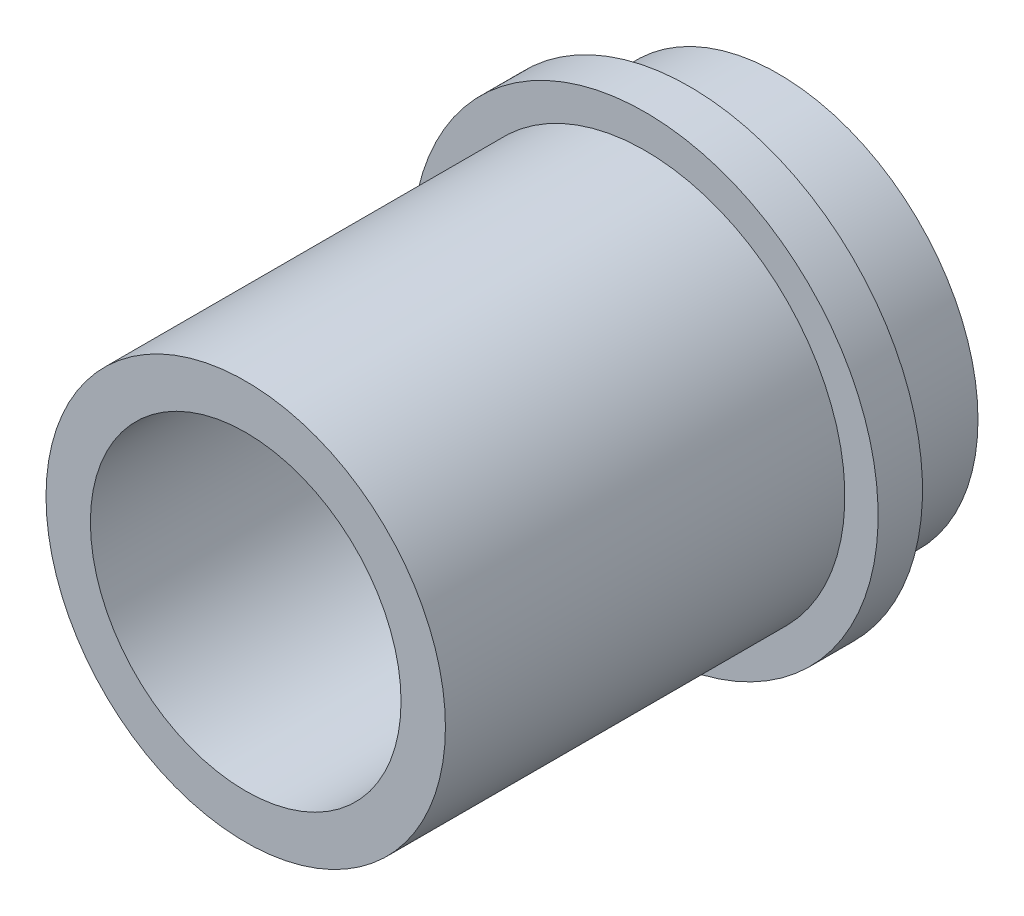
ISO-10303-21;
HEADER;
FILE_DESCRIPTION(('STEP AP214'),'2;1');
FILE_NAME('part.step','',(''),(''),'','','');
FILE_SCHEMA(('AUTOMOTIVE_DESIGN { 1 0 10303 214 1 1 1 1 }'));
ENDSEC;
DATA;
#1=APPLICATION_CONTEXT('core data for automotive mechanical design processes');
#2=APPLICATION_PROTOCOL_DEFINITION('international standard','automotive_design',2000,#1);
#3=PRODUCT_CONTEXT('',#1,'mechanical');
#4=PRODUCT('Part','Part','',(#3));
#5=PRODUCT_RELATED_PRODUCT_CATEGORY('part','',(#4));
#6=PRODUCT_DEFINITION_FORMATION('','',#4);
#7=PRODUCT_DEFINITION_CONTEXT('part definition',#1,'design');
#8=PRODUCT_DEFINITION('design','',#6,#7);
#9=PRODUCT_DEFINITION_SHAPE('','',#8);
#10=(LENGTH_UNIT() NAMED_UNIT(*) SI_UNIT(.MILLI.,.METRE.));
#11=(NAMED_UNIT(*) PLANE_ANGLE_UNIT() SI_UNIT($,.RADIAN.));
#12=(NAMED_UNIT(*) SI_UNIT($,.STERADIAN.) SOLID_ANGLE_UNIT());
#13=UNCERTAINTY_MEASURE_WITH_UNIT(LENGTH_MEASURE(1.E-05),#10,'distance_accuracy_value','');
#14=(GEOMETRIC_REPRESENTATION_CONTEXT(3) GLOBAL_UNCERTAINTY_ASSIGNED_CONTEXT((#13)) GLOBAL_UNIT_ASSIGNED_CONTEXT((#10,
#11,#12)) REPRESENTATION_CONTEXT('',''));
#15=CARTESIAN_POINT('',(0.,0.,0.));
#16=DIRECTION('',(0.,0.,1.));
#17=DIRECTION('',(1.,0.,0.));
#18=AXIS2_PLACEMENT_3D('',#15,#16,#17);
#19=CARTESIAN_POINT('',(0.,0.,20.));
#20=DIRECTION('',(0.,0.,-1.));
#21=DIRECTION('',(-1.,0.,0.));
#22=AXIS2_PLACEMENT_3D('',#19,#20,#21);
#23=CYLINDRICAL_SURFACE('',#22,4.5);
#24=CARTESIAN_POINT('',(0.,0.,20.));
#25=DIRECTION('',(0.,0.,1.));
#26=DIRECTION('',(1.,0.,0.));
#27=AXIS2_PLACEMENT_3D('',#24,#25,#26);
#28=CIRCLE('',#27,4.5);
#29=CARTESIAN_POINT('',(4.5,0.,20.));
#30=VERTEX_POINT('',#29);
#31=EDGE_CURVE('E40',#30,#30,#28,.T.);
#32=ORIENTED_EDGE('',*,*,#31,.F.);
#33=EDGE_LOOP('',(#32));
#34=FACE_BOUND('',#33,.T.);
#35=CARTESIAN_POINT('',(0.,0.,11.));
#36=DIRECTION('',(0.,0.,-1.));
#37=DIRECTION('',(-1.,0.,0.));
#38=AXIS2_PLACEMENT_3D('',#35,#36,#37);
#39=CIRCLE('',#38,4.5);
#40=CARTESIAN_POINT('',(-4.5,0.,11.));
#41=VERTEX_POINT('',#40);
#42=EDGE_CURVE('E10',#41,#41,#39,.T.);
#43=ORIENTED_EDGE('',*,*,#42,.F.);
#44=EDGE_LOOP('',(#43));
#45=FACE_BOUND('',#44,.T.);
#46=ADVANCED_FACE('F32',(#34,#45),#23,.T.);
#47=CARTESIAN_POINT('',(0.,0.,20.));
#48=DIRECTION('',(0.,0.,1.));
#49=DIRECTION('',(1.,0.,0.));
#50=AXIS2_PLACEMENT_3D('',#47,#48,#49);
#51=PLANE('',#50);
#52=ORIENTED_EDGE('',*,*,#31,.T.);
#53=EDGE_LOOP('',(#52));
#54=FACE_BOUND('',#53,.T.);
#55=CARTESIAN_POINT('',(0.,0.,20.));
#56=DIRECTION('',(0.,0.,1.));
#57=DIRECTION('',(1.,0.,0.));
#58=AXIS2_PLACEMENT_3D('',#55,#56,#57);
#59=CIRCLE('',#58,3.5);
#60=CARTESIAN_POINT('',(3.5,0.,20.));
#61=VERTEX_POINT('',#60);
#62=EDGE_CURVE('E49',#61,#61,#59,.T.);
#63=ORIENTED_EDGE('',*,*,#62,.F.);
#64=EDGE_LOOP('',(#63));
#65=FACE_BOUND('',#64,.T.);
#66=ADVANCED_FACE('F81',(#54,#65),#51,.T.);
#67=CARTESIAN_POINT('',(0.,0.,8.));
#68=DIRECTION('',(0.,0.,1.));
#69=DIRECTION('',(1.,0.,0.));
#70=AXIS2_PLACEMENT_3D('',#67,#68,#69);
#71=PLANE('',#70);
#72=CARTESIAN_POINT('',(0.,0.,8.));
#73=DIRECTION('',(0.,0.,1.));
#74=DIRECTION('',(1.,0.,0.));
#75=AXIS2_PLACEMENT_3D('',#72,#73,#74);
#76=CIRCLE('',#75,4.5);
#77=CARTESIAN_POINT('',(4.5,0.,8.));
#78=VERTEX_POINT('',#77);
#79=EDGE_CURVE('E36',#78,#78,#76,.T.);
#80=ORIENTED_EDGE('',*,*,#79,.F.);
#81=EDGE_LOOP('',(#80));
#82=FACE_BOUND('',#81,.T.);
#83=CARTESIAN_POINT('',(0.,0.,8.));
#84=DIRECTION('',(0.,0.,1.));
#85=DIRECTION('',(1.,0.,0.));
#86=AXIS2_PLACEMENT_3D('',#83,#84,#85);
#87=CIRCLE('',#86,3.5);
#88=CARTESIAN_POINT('',(3.5,0.,8.));
#89=VERTEX_POINT('',#88);
#90=EDGE_CURVE('E52',#89,#89,#87,.T.);
#91=ORIENTED_EDGE('',*,*,#90,.T.);
#92=EDGE_LOOP('',(#91));
#93=FACE_BOUND('',#92,.T.);
#94=ADVANCED_FACE('F86',(#82,#93),#71,.F.);
#95=CARTESIAN_POINT('',(0.,0.,10.));
#96=DIRECTION('',(0.,0.,-1.));
#97=DIRECTION('',(-1.,0.,0.));
#98=AXIS2_PLACEMENT_3D('',#95,#96,#97);
#99=CIRCLE('',#98,4.5);
#100=CARTESIAN_POINT('',(-4.5,0.,10.));
#101=VERTEX_POINT('',#100);
#102=EDGE_CURVE('E47',#101,#101,#99,.T.);
#103=ORIENTED_EDGE('',*,*,#102,.T.);
#104=EDGE_LOOP('',(#103));
#105=FACE_BOUND('',#104,.T.);
#106=ORIENTED_EDGE('',*,*,#79,.T.);
#107=EDGE_LOOP('',(#106));
#108=FACE_BOUND('',#107,.T.);
#109=ADVANCED_FACE('F34',(#105,#108),#23,.T.);
#110=CARTESIAN_POINT('',(0.,0.,20.));
#111=DIRECTION('',(0.,0.,-1.));
#112=DIRECTION('',(-1.,0.,0.));
#113=AXIS2_PLACEMENT_3D('',#110,#111,#112);
#114=CYLINDRICAL_SURFACE('',#113,3.5);
#115=ORIENTED_EDGE('',*,*,#90,.F.);
#116=EDGE_LOOP('',(#115));
#117=FACE_BOUND('',#116,.T.);
#118=ORIENTED_EDGE('',*,*,#62,.T.);
#119=EDGE_LOOP('',(#118));
#120=FACE_BOUND('',#119,.T.);
#121=ADVANCED_FACE('F92',(#117,#120),#114,.F.);
#122=CARTESIAN_POINT('',(0.,0.,11.));
#123=DIRECTION('',(0.,0.,-1.));
#124=DIRECTION('',(-1.,0.,0.));
#125=AXIS2_PLACEMENT_3D('',#122,#123,#124);
#126=PLANE('',#125);
#127=CARTESIAN_POINT('',(0.,0.,11.));
#128=DIRECTION('',(0.,0.,-1.));
#129=DIRECTION('',(-1.,0.,0.));
#130=AXIS2_PLACEMENT_3D('',#127,#128,#129);
#131=CIRCLE('',#130,5.25);
#132=CARTESIAN_POINT('',(-5.25,0.,11.));
#133=VERTEX_POINT('',#132);
#134=EDGE_CURVE('E57',#133,#133,#131,.T.);
#135=ORIENTED_EDGE('',*,*,#134,.F.);
#136=EDGE_LOOP('',(#135));
#137=FACE_BOUND('',#136,.T.);
#138=ORIENTED_EDGE('',*,*,#42,.T.);
#139=EDGE_LOOP('',(#138));
#140=FACE_BOUND('',#139,.T.);
#141=ADVANCED_FACE('F77',(#137,#140),#126,.F.);
#142=CARTESIAN_POINT('',(0.,0.,10.));
#143=DIRECTION('',(0.,0.,-1.));
#144=DIRECTION('',(-1.,0.,0.));
#145=AXIS2_PLACEMENT_3D('',#142,#143,#144);
#146=PLANE('',#145);
#147=CARTESIAN_POINT('',(0.,0.,10.));
#148=DIRECTION('',(0.,0.,-1.));
#149=DIRECTION('',(-1.,0.,0.));
#150=AXIS2_PLACEMENT_3D('',#147,#148,#149);
#151=CIRCLE('',#150,5.25);
#152=CARTESIAN_POINT('',(-5.25,0.,10.));
#153=VERTEX_POINT('',#152);
#154=EDGE_CURVE('E61',#153,#153,#151,.T.);
#155=ORIENTED_EDGE('',*,*,#154,.T.);
#156=EDGE_LOOP('',(#155));
#157=FACE_BOUND('',#156,.T.);
#158=ORIENTED_EDGE('',*,*,#102,.F.);
#159=EDGE_LOOP('',(#158));
#160=FACE_BOUND('',#159,.T.);
#161=ADVANCED_FACE('F68',(#157,#160),#146,.T.);
#162=CARTESIAN_POINT('',(0.,0.,11.));
#163=DIRECTION('',(0.,0.,-1.));
#164=DIRECTION('',(-1.,0.,0.));
#165=AXIS2_PLACEMENT_3D('',#162,#163,#164);
#166=CYLINDRICAL_SURFACE('',#165,5.25);
#167=ORIENTED_EDGE('',*,*,#134,.T.);
#168=EDGE_LOOP('',(#167));
#169=FACE_BOUND('',#168,.T.);
#170=ORIENTED_EDGE('',*,*,#154,.F.);
#171=EDGE_LOOP('',(#170));
#172=FACE_BOUND('',#171,.T.);
#173=ADVANCED_FACE('F71',(#169,#172),#166,.T.);
#174=CLOSED_SHELL('',(#46,#66,#94,#109,#121,#141,#161,#173));
#175=MANIFOLD_SOLID_BREP('B2',#174);
#176=ADVANCED_BREP_SHAPE_REPRESENTATION('',(#18,#175),#14);
#177=SHAPE_DEFINITION_REPRESENTATION(#9,#176);
ENDSEC;
END-ISO-10303-21;
